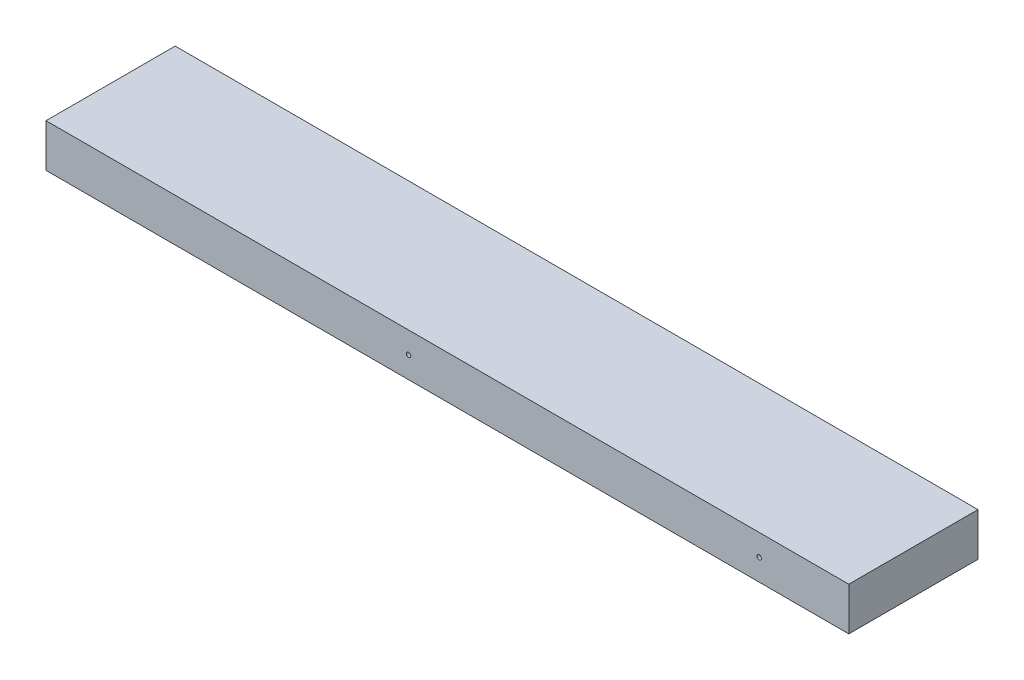
ISO-10303-21;
HEADER;
FILE_DESCRIPTION(('STEP AP214'),'2;1');
FILE_NAME('part.step','',(''),(''),'','','');
FILE_SCHEMA(('AUTOMOTIVE_DESIGN { 1 0 10303 214 1 1 1 1 }'));
ENDSEC;
DATA;
#1=APPLICATION_CONTEXT('core data for automotive mechanical design processes');
#2=APPLICATION_PROTOCOL_DEFINITION('international standard','automotive_design',2000,#1);
#3=PRODUCT_CONTEXT('',#1,'mechanical');
#4=PRODUCT('Part','Part','',(#3));
#5=PRODUCT_RELATED_PRODUCT_CATEGORY('part','',(#4));
#6=PRODUCT_DEFINITION_FORMATION('','',#4);
#7=PRODUCT_DEFINITION_CONTEXT('part definition',#1,'design');
#8=PRODUCT_DEFINITION('design','',#6,#7);
#9=PRODUCT_DEFINITION_SHAPE('','',#8);
#10=(LENGTH_UNIT() NAMED_UNIT(*) SI_UNIT(.MILLI.,.METRE.));
#11=(NAMED_UNIT(*) PLANE_ANGLE_UNIT() SI_UNIT($,.RADIAN.));
#12=(NAMED_UNIT(*) SI_UNIT($,.STERADIAN.) SOLID_ANGLE_UNIT());
#13=UNCERTAINTY_MEASURE_WITH_UNIT(LENGTH_MEASURE(1.E-05),#10,'distance_accuracy_value','');
#14=(GEOMETRIC_REPRESENTATION_CONTEXT(3) GLOBAL_UNCERTAINTY_ASSIGNED_CONTEXT((#13)) GLOBAL_UNIT_ASSIGNED_CONTEXT((#10,
#11,#12)) REPRESENTATION_CONTEXT('',''));
#15=CARTESIAN_POINT('',(0.,0.,0.));
#16=DIRECTION('',(0.,0.,1.));
#17=DIRECTION('',(1.,0.,0.));
#18=AXIS2_PLACEMENT_3D('',#15,#16,#17);
#19=CARTESIAN_POINT('',(-86.3599999999984,5213.35,2683.51));
#20=DIRECTION('',(0.,-1.,0.));
#21=DIRECTION('',(0.,0.,-1.));
#22=AXIS2_PLACEMENT_3D('',#19,#20,#21);
#23=PLANE('',#22);
#24=DIRECTION('',(0.,0.,-1.));
#25=VECTOR('',#24,1.);
#26=CARTESIAN_POINT('',(-90.1229654482436,5213.35,2740.66));
#27=LINE('',#26,#25);
#28=CARTESIAN_POINT('',(-90.1229654482436,5213.35,2740.66));
#29=VERTEX_POINT('',#28);
#30=CARTESIAN_POINT('',(-90.1229654482432,5213.35,2683.51));
#31=VERTEX_POINT('',#30);
#32=EDGE_CURVE('E99',#29,#31,#27,.T.);
#33=ORIENTED_EDGE('',*,*,#32,.F.);
#34=DIRECTION('',(1.,0.,0.));
#35=VECTOR('',#34,1.);
#36=CARTESIAN_POINT('',(-265.815570864871,5213.35,2740.66));
#37=LINE('',#36,#35);
#38=CARTESIAN_POINT('',(-445.271141729743,5213.35,2740.66));
#39=VERTEX_POINT('',#38);
#40=EDGE_CURVE('E107',#39,#29,#37,.T.);
#41=ORIENTED_EDGE('',*,*,#40,.F.);
#42=DIRECTION('',(0.,0.,-1.));
#43=VECTOR('',#42,1.);
#44=CARTESIAN_POINT('',(-445.271141729742,5213.35,2683.51));
#45=LINE('',#44,#43);
#46=CARTESIAN_POINT('',(-445.271141729742,5213.35,2683.51));
#47=VERTEX_POINT('',#46);
#48=EDGE_CURVE('E113',#39,#47,#45,.T.);
#49=ORIENTED_EDGE('',*,*,#48,.T.);
#50=DIRECTION('',(-1.,0.,0.));
#51=VECTOR('',#50,1.);
#52=CARTESIAN_POINT('',(-265.81557086487,5213.35,2683.51));
#53=LINE('',#52,#51);
#54=EDGE_CURVE('E108',#31,#47,#53,.T.);
#55=ORIENTED_EDGE('',*,*,#54,.F.);
#56=EDGE_LOOP('',(#33,#41,#49,#55));
#57=FACE_BOUND('',#56,.T.);
#58=ADVANCED_FACE('F44',(#57),#23,.T.);
#59=CARTESIAN_POINT('',(-265.815570864871,5222.875,2740.66));
#60=DIRECTION('',(0.,0.,-1.));
#61=DIRECTION('',(1.,0.,0.));
#62=AXIS2_PLACEMENT_3D('',#59,#60,#61);
#63=PLANE('',#62);
#64=CARTESIAN_POINT('',(-129.74574903147,5222.875,2740.66));
#65=DIRECTION('',(0.,0.,1.));
#66=DIRECTION('',(1.,0.,0.));
#67=AXIS2_PLACEMENT_3D('',#64,#65,#66);
#68=CIRCLE('',#67,0.991870000000006);
#69=CARTESIAN_POINT('',(-128.75387903147,5222.875,2740.66));
#70=VERTEX_POINT('',#69);
#71=EDGE_CURVE('E47',#70,#70,#68,.T.);
#72=ORIENTED_EDGE('',*,*,#71,.F.);
#73=EDGE_LOOP('',(#72));
#74=FACE_BOUND('',#73,.T.);
#75=CARTESIAN_POINT('',(-284.876857239857,5222.875,2740.66));
#76=DIRECTION('',(0.,0.,1.));
#77=DIRECTION('',(1.,0.,0.));
#78=AXIS2_PLACEMENT_3D('',#75,#76,#77);
#79=CIRCLE('',#78,0.991870000000006);
#80=CARTESIAN_POINT('',(-283.884987239857,5222.875,2740.66));
#81=VERTEX_POINT('',#80);
#82=EDGE_CURVE('E111',#81,#81,#79,.T.);
#83=ORIENTED_EDGE('',*,*,#82,.F.);
#84=EDGE_LOOP('',(#83));
#85=FACE_BOUND('',#84,.T.);
#86=ORIENTED_EDGE('',*,*,#40,.T.);
#87=DIRECTION('',(0.,1.,0.));
#88=VECTOR('',#87,1.);
#89=CARTESIAN_POINT('',(-90.1229654482436,5213.35,2740.66));
#90=LINE('',#89,#88);
#91=CARTESIAN_POINT('',(-90.1229654482438,5232.4,2740.66));
#92=VERTEX_POINT('',#91);
#93=EDGE_CURVE('E96',#29,#92,#90,.T.);
#94=ORIENTED_EDGE('',*,*,#93,.T.);
#95=DIRECTION('',(-1.,0.,0.));
#96=VECTOR('',#95,1.);
#97=CARTESIAN_POINT('',(-445.271141729744,5232.4,2740.66));
#98=LINE('',#97,#96);
#99=CARTESIAN_POINT('',(-445.271141729743,5232.4,2740.66));
#100=VERTEX_POINT('',#99);
#101=EDGE_CURVE('E123',#92,#100,#98,.T.);
#102=ORIENTED_EDGE('',*,*,#101,.T.);
#103=DIRECTION('',(0.,1.,0.));
#104=VECTOR('',#103,1.);
#105=CARTESIAN_POINT('',(-445.271141729743,5213.35,2740.66));
#106=LINE('',#105,#104);
#107=EDGE_CURVE('E81',#100,#39,#106,.F.);
#108=ORIENTED_EDGE('',*,*,#107,.T.);
#109=EDGE_LOOP('',(#86,#94,#102,#108));
#110=FACE_BOUND('',#109,.T.);
#111=ADVANCED_FACE('F110',(#74,#85,#110),#63,.F.);
#112=CARTESIAN_POINT('',(-445.271141729742,5213.35,2683.51));
#113=DIRECTION('',(-1.,0.,0.));
#114=DIRECTION('',(0.,0.,-1.));
#115=AXIS2_PLACEMENT_3D('',#112,#113,#114);
#116=PLANE('',#115);
#117=DIRECTION('',(0.,1.,0.));
#118=VECTOR('',#117,1.);
#119=CARTESIAN_POINT('',(-445.271141729742,5222.875,2683.51));
#120=LINE('',#119,#118);
#121=CARTESIAN_POINT('',(-445.271141729744,5232.4,2683.51));
#122=VERTEX_POINT('',#121);
#123=EDGE_CURVE('E120',#47,#122,#120,.T.);
#124=ORIENTED_EDGE('',*,*,#123,.F.);
#125=ORIENTED_EDGE('',*,*,#48,.F.);
#126=ORIENTED_EDGE('',*,*,#107,.F.);
#127=DIRECTION('',(0.,0.,1.));
#128=VECTOR('',#127,1.);
#129=CARTESIAN_POINT('',(-445.271141729744,5232.4,2683.51));
#130=LINE('',#129,#128);
#131=EDGE_CURVE('E52',#100,#122,#130,.F.);
#132=ORIENTED_EDGE('',*,*,#131,.T.);
#133=EDGE_LOOP('',(#124,#125,#126,#132));
#134=FACE_BOUND('',#133,.T.);
#135=ADVANCED_FACE('F137',(#134),#116,.T.);
#136=CARTESIAN_POINT('',(-265.815570864871,5222.875,2683.51));
#137=DIRECTION('',(0.,0.,1.));
#138=DIRECTION('',(-1.,0.,0.));
#139=AXIS2_PLACEMENT_3D('',#136,#137,#138);
#140=PLANE('',#139);
#141=DIRECTION('',(-1.,0.,0.));
#142=VECTOR('',#141,1.);
#143=CARTESIAN_POINT('',(-445.271141729744,5232.4,2683.51));
#144=LINE('',#143,#142);
#145=CARTESIAN_POINT('',(-90.1229654482437,5232.4,2683.51));
#146=VERTEX_POINT('',#145);
#147=EDGE_CURVE('E11',#122,#146,#144,.F.);
#148=ORIENTED_EDGE('',*,*,#147,.T.);
#149=DIRECTION('',(0.,1.,0.));
#150=VECTOR('',#149,1.);
#151=CARTESIAN_POINT('',(-90.1229654482432,5213.35,2683.51));
#152=LINE('',#151,#150);
#153=EDGE_CURVE('E60',#31,#146,#152,.T.);
#154=ORIENTED_EDGE('',*,*,#153,.F.);
#155=ORIENTED_EDGE('',*,*,#54,.T.);
#156=ORIENTED_EDGE('',*,*,#123,.T.);
#157=EDGE_LOOP('',(#148,#154,#155,#156));
#158=FACE_BOUND('',#157,.T.);
#159=ADVANCED_FACE('F134',(#158),#140,.F.);
#160=CARTESIAN_POINT('',(-445.271141729744,5232.4,2683.51));
#161=DIRECTION('',(0.,1.,0.));
#162=DIRECTION('',(0.,0.,1.));
#163=AXIS2_PLACEMENT_3D('',#160,#161,#162);
#164=PLANE('',#163);
#165=DIRECTION('',(0.,0.,-1.));
#166=VECTOR('',#165,1.);
#167=CARTESIAN_POINT('',(-90.1229654482438,5232.4,2740.66));
#168=LINE('',#167,#166);
#169=EDGE_CURVE('E100',#92,#146,#168,.T.);
#170=ORIENTED_EDGE('',*,*,#169,.T.);
#171=ORIENTED_EDGE('',*,*,#147,.F.);
#172=ORIENTED_EDGE('',*,*,#131,.F.);
#173=ORIENTED_EDGE('',*,*,#101,.F.);
#174=EDGE_LOOP('',(#170,#171,#172,#173));
#175=FACE_BOUND('',#174,.T.);
#176=ADVANCED_FACE('F132',(#175),#164,.T.);
#177=CARTESIAN_POINT('',(-284.876857239857,5222.875,2759.71000000001));
#178=DIRECTION('',(0.,0.,1.));
#179=DIRECTION('',(-1.,0.,0.));
#180=AXIS2_PLACEMENT_3D('',#177,#178,#179);
#181=CYLINDRICAL_SURFACE('',#180,0.991870000000006);
#182=CARTESIAN_POINT('',(-284.876857239858,5222.875,2721.61000000001));
#183=DIRECTION('',(0.,0.,-1.));
#184=DIRECTION('',(-1.,0.,0.));
#185=AXIS2_PLACEMENT_3D('',#182,#183,#184);
#186=CIRCLE('',#185,0.991870000000006);
#187=CARTESIAN_POINT('',(-285.868727239858,5222.875,2721.61000000001));
#188=VERTEX_POINT('',#187);
#189=EDGE_CURVE('E116',#188,#188,#186,.T.);
#190=ORIENTED_EDGE('',*,*,#189,.T.);
#191=EDGE_LOOP('',(#190));
#192=FACE_BOUND('',#191,.T.);
#193=ORIENTED_EDGE('',*,*,#82,.T.);
#194=EDGE_LOOP('',(#193));
#195=FACE_BOUND('',#194,.T.);
#196=ADVANCED_FACE('F176',(#192,#195),#181,.F.);
#197=CARTESIAN_POINT('',(-284.876857239858,5222.875,2721.61000000001));
#198=DIRECTION('',(0.,0.,1.));
#199=DIRECTION('',(-1.,0.,0.));
#200=AXIS2_PLACEMENT_3D('',#197,#198,#199);
#201=CONICAL_SURFACE('',#200,0.991870000000006,1.02974425867677);
#202=CARTESIAN_POINT('',(-284.876857239857,5222.875,2721.01402437781));
#203=VERTEX_POINT('',#202);
#204=VERTEX_LOOP('',#203);
#205=FACE_BOUND('',#204,.T.);
#206=ORIENTED_EDGE('',*,*,#189,.F.);
#207=EDGE_LOOP('',(#206));
#208=FACE_BOUND('',#207,.T.);
#209=ADVANCED_FACE('F186',(#205,#208),#201,.F.);
#210=CARTESIAN_POINT('',(-129.745749031471,5222.875,2759.71000000001));
#211=DIRECTION('',(0.,0.,1.));
#212=DIRECTION('',(-1.,0.,0.));
#213=AXIS2_PLACEMENT_3D('',#210,#211,#212);
#214=CYLINDRICAL_SURFACE('',#213,0.991870000000006);
#215=CARTESIAN_POINT('',(-129.74574903147,5222.875,2721.61000000001));
#216=DIRECTION('',(0.,0.,-1.));
#217=DIRECTION('',(-1.,0.,0.));
#218=AXIS2_PLACEMENT_3D('',#215,#216,#217);
#219=CIRCLE('',#218,0.991870000000006);
#220=CARTESIAN_POINT('',(-130.73761903147,5222.875,2721.61000000001));
#221=VERTEX_POINT('',#220);
#222=EDGE_CURVE('E128',#221,#221,#219,.T.);
#223=ORIENTED_EDGE('',*,*,#222,.T.);
#224=EDGE_LOOP('',(#223));
#225=FACE_BOUND('',#224,.T.);
#226=ORIENTED_EDGE('',*,*,#71,.T.);
#227=EDGE_LOOP('',(#226));
#228=FACE_BOUND('',#227,.T.);
#229=ADVANCED_FACE('F196',(#225,#228),#214,.F.);
#230=CARTESIAN_POINT('',(-129.74574903147,5222.875,2721.61000000001));
#231=DIRECTION('',(0.,0.,1.));
#232=DIRECTION('',(-1.,0.,0.));
#233=AXIS2_PLACEMENT_3D('',#230,#231,#232);
#234=CONICAL_SURFACE('',#233,0.991870000000006,1.02974425867677);
#235=CARTESIAN_POINT('',(-129.74574903147,5222.875,2721.01402437781));
#236=VERTEX_POINT('',#235);
#237=VERTEX_LOOP('',#236);
#238=FACE_BOUND('',#237,.T.);
#239=ORIENTED_EDGE('',*,*,#222,.F.);
#240=EDGE_LOOP('',(#239));
#241=FACE_BOUND('',#240,.T.);
#242=ADVANCED_FACE('F205',(#238,#241),#234,.F.);
#243=CARTESIAN_POINT('',(-90.1229654482436,5213.35,2740.66));
#244=DIRECTION('',(-1.,0.,0.));
#245=DIRECTION('',(0.,0.,1.));
#246=AXIS2_PLACEMENT_3D('',#243,#244,#245);
#247=PLANE('',#246);
#248=ORIENTED_EDGE('',*,*,#153,.T.);
#249=ORIENTED_EDGE('',*,*,#169,.F.);
#250=ORIENTED_EDGE('',*,*,#93,.F.);
#251=ORIENTED_EDGE('',*,*,#32,.T.);
#252=EDGE_LOOP('',(#248,#249,#250,#251));
#253=FACE_BOUND('',#252,.T.);
#254=ADVANCED_FACE('F98',(#253),#247,.F.);
#255=CLOSED_SHELL('',(#58,#111,#135,#159,#176,#196,#209,#229,#242,#254));
#256=MANIFOLD_SOLID_BREP('B2',#255);
#257=ADVANCED_BREP_SHAPE_REPRESENTATION('',(#18,#256),#14);
#258=SHAPE_DEFINITION_REPRESENTATION(#9,#257);
ENDSEC;
END-ISO-10303-21;
